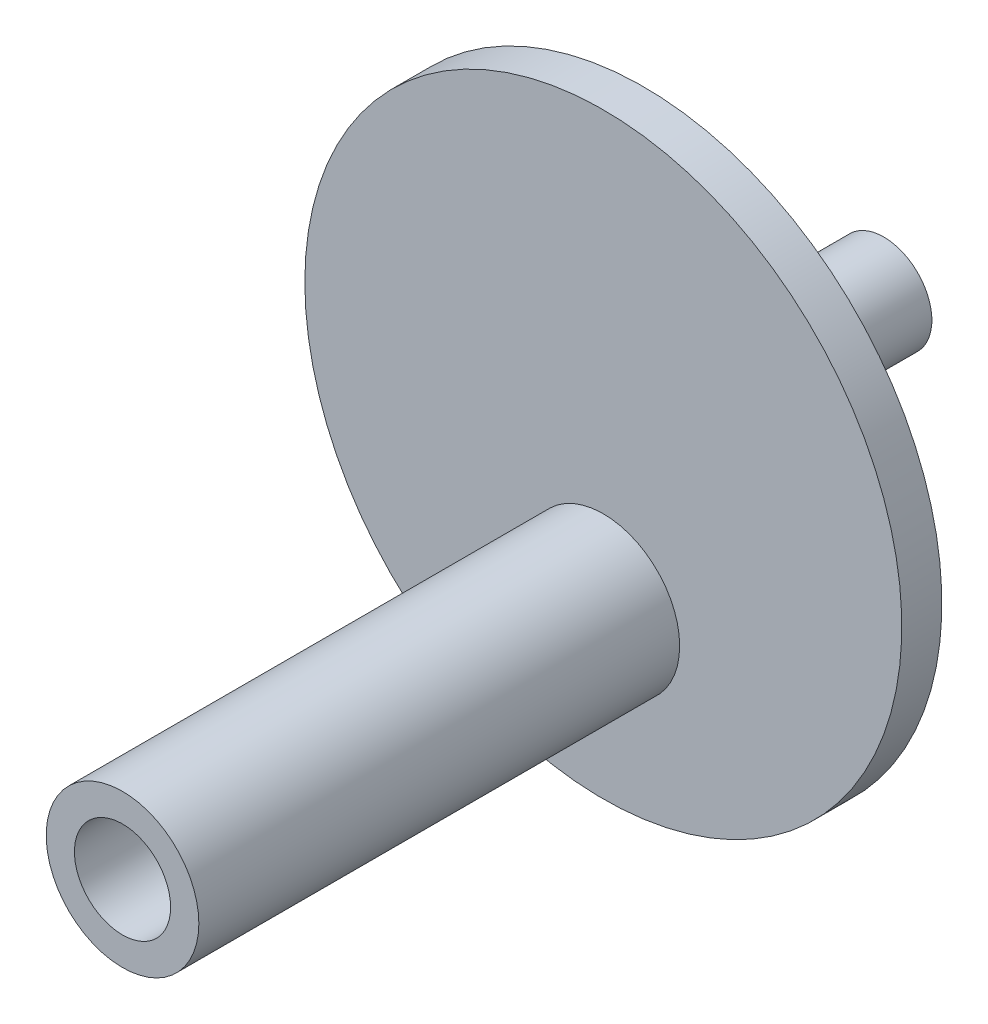
ISO-10303-21;
HEADER;
FILE_DESCRIPTION(('STEP AP214'),'2;1');
FILE_NAME('part.step','',(''),(''),'','','');
FILE_SCHEMA(('AUTOMOTIVE_DESIGN { 1 0 10303 214 1 1 1 1 }'));
ENDSEC;
DATA;
#1=APPLICATION_CONTEXT('core data for automotive mechanical design processes');
#2=APPLICATION_PROTOCOL_DEFINITION('international standard','automotive_design',2000,#1);
#3=PRODUCT_CONTEXT('',#1,'mechanical');
#4=PRODUCT('Part','Part','',(#3));
#5=PRODUCT_RELATED_PRODUCT_CATEGORY('part','',(#4));
#6=PRODUCT_DEFINITION_FORMATION('','',#4);
#7=PRODUCT_DEFINITION_CONTEXT('part definition',#1,'design');
#8=PRODUCT_DEFINITION('design','',#6,#7);
#9=PRODUCT_DEFINITION_SHAPE('','',#8);
#10=(LENGTH_UNIT() NAMED_UNIT(*) SI_UNIT(.MILLI.,.METRE.));
#11=(NAMED_UNIT(*) PLANE_ANGLE_UNIT() SI_UNIT($,.RADIAN.));
#12=(NAMED_UNIT(*) SI_UNIT($,.STERADIAN.) SOLID_ANGLE_UNIT());
#13=UNCERTAINTY_MEASURE_WITH_UNIT(LENGTH_MEASURE(1.E-05),#10,'distance_accuracy_value','');
#14=(GEOMETRIC_REPRESENTATION_CONTEXT(3) GLOBAL_UNCERTAINTY_ASSIGNED_CONTEXT((#13)) GLOBAL_UNIT_ASSIGNED_CONTEXT((#10,
#11,#12)) REPRESENTATION_CONTEXT('',''));
#15=CARTESIAN_POINT('',(0.,0.,0.));
#16=DIRECTION('',(0.,0.,1.));
#17=DIRECTION('',(1.,0.,0.));
#18=AXIS2_PLACEMENT_3D('',#15,#16,#17);
#19=CARTESIAN_POINT('',(0.,0.,-30.));
#20=DIRECTION('',(0.,0.,-1.));
#21=DIRECTION('',(-1.,0.,0.));
#22=AXIS2_PLACEMENT_3D('',#19,#20,#21);
#23=CYLINDRICAL_SURFACE('',#22,8.);
#24=CARTESIAN_POINT('',(0.,0.,0.));
#25=DIRECTION('',(0.,0.,-1.));
#26=DIRECTION('',(-1.,0.,0.));
#27=AXIS2_PLACEMENT_3D('',#24,#25,#26);
#28=CIRCLE('',#27,8.);
#29=CARTESIAN_POINT('',(-8.,0.,0.));
#30=VERTEX_POINT('',#29);
#31=EDGE_CURVE('E59',#30,#30,#28,.T.);
#32=ORIENTED_EDGE('',*,*,#31,.T.);
#33=EDGE_LOOP('',(#32));
#34=FACE_BOUND('',#33,.T.);
#35=CARTESIAN_POINT('',(0.,0.,-15.1));
#36=DIRECTION('',(0.,0.,-1.));
#37=DIRECTION('',(-1.,0.,0.));
#38=AXIS2_PLACEMENT_3D('',#35,#36,#37);
#39=CIRCLE('',#38,8.);
#40=CARTESIAN_POINT('',(-8.,0.,-15.1));
#41=VERTEX_POINT('',#40);
#42=EDGE_CURVE('E40',#41,#41,#39,.T.);
#43=ORIENTED_EDGE('',*,*,#42,.F.);
#44=EDGE_LOOP('',(#43));
#45=FACE_BOUND('',#44,.T.);
#46=ADVANCED_FACE('F34',(#34,#45),#23,.T.);
#47=CARTESIAN_POINT('',(0.,8.,-15.1));
#48=DIRECTION('',(0.,0.,-1.));
#49=DIRECTION('',(-1.,0.,0.));
#50=AXIS2_PLACEMENT_3D('',#47,#48,#49);
#51=PLANE('',#50);
#52=ORIENTED_EDGE('',*,*,#42,.T.);
#53=EDGE_LOOP('',(#52));
#54=FACE_BOUND('',#53,.T.);
#55=CARTESIAN_POINT('',(0.,0.,-15.1));
#56=DIRECTION('',(0.,0.,-1.));
#57=DIRECTION('',(-1.,0.,0.));
#58=AXIS2_PLACEMENT_3D('',#55,#56,#57);
#59=CIRCLE('',#58,6.);
#60=CARTESIAN_POINT('',(-6.,0.,-15.1));
#61=VERTEX_POINT('',#60);
#62=EDGE_CURVE('E44',#61,#61,#59,.T.);
#63=ORIENTED_EDGE('',*,*,#62,.F.);
#64=EDGE_LOOP('',(#63));
#65=FACE_BOUND('',#64,.T.);
#66=ADVANCED_FACE('F91',(#54,#65),#51,.T.);
#67=CARTESIAN_POINT('',(0.,0.,-30.));
#68=DIRECTION('',(0.,0.,-1.));
#69=DIRECTION('',(-1.,0.,0.));
#70=AXIS2_PLACEMENT_3D('',#67,#68,#69);
#71=CYLINDRICAL_SURFACE('',#70,6.);
#72=ORIENTED_EDGE('',*,*,#62,.T.);
#73=EDGE_LOOP('',(#72));
#74=FACE_BOUND('',#73,.T.);
#75=CARTESIAN_POINT('',(0.,0.,-30.));
#76=DIRECTION('',(0.,0.,-1.));
#77=DIRECTION('',(-1.,0.,0.));
#78=AXIS2_PLACEMENT_3D('',#75,#76,#77);
#79=CIRCLE('',#78,6.);
#80=CARTESIAN_POINT('',(-6.,0.,-30.));
#81=VERTEX_POINT('',#80);
#82=EDGE_CURVE('E48',#81,#81,#79,.T.);
#83=ORIENTED_EDGE('',*,*,#82,.F.);
#84=EDGE_LOOP('',(#83));
#85=FACE_BOUND('',#84,.T.);
#86=ADVANCED_FACE('F96',(#74,#85),#71,.T.);
#87=CARTESIAN_POINT('',(0.,6.,-30.));
#88=DIRECTION('',(0.,0.,-1.));
#89=DIRECTION('',(-1.,0.,0.));
#90=AXIS2_PLACEMENT_3D('',#87,#88,#89);
#91=PLANE('',#90);
#92=ORIENTED_EDGE('',*,*,#82,.T.);
#93=EDGE_LOOP('',(#92));
#94=FACE_BOUND('',#93,.T.);
#95=ADVANCED_FACE('F103',(#94),#91,.T.);
#96=CARTESIAN_POINT('',(0.,37.25,5.));
#97=DIRECTION('',(0.,0.,1.));
#98=DIRECTION('',(1.,0.,0.));
#99=AXIS2_PLACEMENT_3D('',#96,#97,#98);
#100=PLANE('',#99);
#101=CARTESIAN_POINT('',(0.,-15.9375,5.));
#102=DIRECTION('',(0.,0.,1.));
#103=DIRECTION('',(1.,0.,0.));
#104=AXIS2_PLACEMENT_3D('',#101,#102,#103);
#105=CIRCLE('',#104,9.525);
#106=CARTESIAN_POINT('',(9.525,-15.9375,5.));
#107=VERTEX_POINT('',#106);
#108=EDGE_CURVE('E63',#107,#107,#105,.T.);
#109=ORIENTED_EDGE('',*,*,#108,.F.);
#110=EDGE_LOOP('',(#109));
#111=FACE_BOUND('',#110,.T.);
#112=CARTESIAN_POINT('',(0.,0.,5.));
#113=DIRECTION('',(0.,0.,-1.));
#114=DIRECTION('',(-1.,0.,0.));
#115=AXIS2_PLACEMENT_3D('',#112,#113,#114);
#116=CIRCLE('',#115,37.25);
#117=CARTESIAN_POINT('',(-37.25,0.,5.));
#118=VERTEX_POINT('',#117);
#119=EDGE_CURVE('E53',#118,#118,#116,.T.);
#120=ORIENTED_EDGE('',*,*,#119,.F.);
#121=EDGE_LOOP('',(#120));
#122=FACE_BOUND('',#121,.T.);
#123=ADVANCED_FACE('F110',(#111,#122),#100,.T.);
#124=CARTESIAN_POINT('',(0.,0.,-30.));
#125=DIRECTION('',(0.,0.,-1.));
#126=DIRECTION('',(-1.,0.,0.));
#127=AXIS2_PLACEMENT_3D('',#124,#125,#126);
#128=CYLINDRICAL_SURFACE('',#127,37.25);
#129=ORIENTED_EDGE('',*,*,#119,.T.);
#130=EDGE_LOOP('',(#129));
#131=FACE_BOUND('',#130,.T.);
#132=CARTESIAN_POINT('',(0.,0.,0.));
#133=DIRECTION('',(0.,0.,-1.));
#134=DIRECTION('',(-1.,0.,0.));
#135=AXIS2_PLACEMENT_3D('',#132,#133,#134);
#136=CIRCLE('',#135,37.25);
#137=CARTESIAN_POINT('',(-37.25,0.,0.));
#138=VERTEX_POINT('',#137);
#139=EDGE_CURVE('E56',#138,#138,#136,.T.);
#140=ORIENTED_EDGE('',*,*,#139,.F.);
#141=EDGE_LOOP('',(#140));
#142=FACE_BOUND('',#141,.T.);
#143=ADVANCED_FACE('F86',(#131,#142),#128,.T.);
#144=CARTESIAN_POINT('',(0.,8.,0.));
#145=DIRECTION('',(0.,0.,-1.));
#146=DIRECTION('',(-1.,0.,0.));
#147=AXIS2_PLACEMENT_3D('',#144,#145,#146);
#148=PLANE('',#147);
#149=ORIENTED_EDGE('',*,*,#139,.T.);
#150=EDGE_LOOP('',(#149));
#151=FACE_BOUND('',#150,.T.);
#152=ORIENTED_EDGE('',*,*,#31,.F.);
#153=EDGE_LOOP('',(#152));
#154=FACE_BOUND('',#153,.T.);
#155=ADVANCED_FACE('F77',(#151,#154),#148,.T.);
#156=CARTESIAN_POINT('',(0.,-15.9375,65.));
#157=DIRECTION('',(0.,0.,1.));
#158=DIRECTION('',(1.,0.,0.));
#159=AXIS2_PLACEMENT_3D('',#156,#157,#158);
#160=PLANE('',#159);
#161=CARTESIAN_POINT('',(0.,-15.9375,65.));
#162=DIRECTION('',(0.,0.,1.));
#163=DIRECTION('',(1.,0.,0.));
#164=AXIS2_PLACEMENT_3D('',#161,#162,#163);
#165=CIRCLE('',#164,9.525);
#166=CARTESIAN_POINT('',(9.525,-15.9375,65.));
#167=VERTEX_POINT('',#166);
#168=EDGE_CURVE('E62',#167,#167,#165,.T.);
#169=ORIENTED_EDGE('',*,*,#168,.T.);
#170=EDGE_LOOP('',(#169));
#171=FACE_BOUND('',#170,.T.);
#172=CARTESIAN_POINT('',(0.,-15.9375,65.));
#173=DIRECTION('',(0.,0.,1.));
#174=DIRECTION('',(1.,0.,0.));
#175=AXIS2_PLACEMENT_3D('',#172,#173,#174);
#176=CIRCLE('',#175,6.);
#177=CARTESIAN_POINT('',(6.,-15.9375,65.));
#178=VERTEX_POINT('',#177);
#179=EDGE_CURVE('E66',#178,#178,#176,.T.);
#180=ORIENTED_EDGE('',*,*,#179,.F.);
#181=EDGE_LOOP('',(#180));
#182=FACE_BOUND('',#181,.T.);
#183=ADVANCED_FACE('F74',(#171,#182),#160,.T.);
#184=CARTESIAN_POINT('',(0.,-15.9375,65.));
#185=DIRECTION('',(0.,0.,-1.));
#186=DIRECTION('',(-1.,0.,0.));
#187=AXIS2_PLACEMENT_3D('',#184,#185,#186);
#188=CYLINDRICAL_SURFACE('',#187,9.525);
#189=ORIENTED_EDGE('',*,*,#168,.F.);
#190=EDGE_LOOP('',(#189));
#191=FACE_BOUND('',#190,.T.);
#192=ORIENTED_EDGE('',*,*,#108,.T.);
#193=EDGE_LOOP('',(#192));
#194=FACE_BOUND('',#193,.T.);
#195=ADVANCED_FACE('F76',(#191,#194),#188,.T.);
#196=CARTESIAN_POINT('',(0.,-15.9375,65.));
#197=DIRECTION('',(0.,0.,-1.));
#198=DIRECTION('',(-1.,0.,0.));
#199=AXIS2_PLACEMENT_3D('',#196,#197,#198);
#200=CYLINDRICAL_SURFACE('',#199,6.);
#201=ORIENTED_EDGE('',*,*,#179,.T.);
#202=EDGE_LOOP('',(#201));
#203=FACE_BOUND('',#202,.T.);
#204=CARTESIAN_POINT('',(0.,-15.9375,5.));
#205=DIRECTION('',(0.,0.,1.));
#206=DIRECTION('',(1.,0.,0.));
#207=AXIS2_PLACEMENT_3D('',#204,#205,#206);
#208=CIRCLE('',#207,6.);
#209=CARTESIAN_POINT('',(6.,-15.9375,5.));
#210=VERTEX_POINT('',#209);
#211=EDGE_CURVE('E10',#210,#210,#208,.F.);
#212=ORIENTED_EDGE('',*,*,#211,.T.);
#213=EDGE_LOOP('',(#212));
#214=FACE_BOUND('',#213,.T.);
#215=ADVANCED_FACE('F72',(#203,#214),#200,.F.);
#216=ORIENTED_EDGE('',*,*,#211,.F.);
#217=EDGE_LOOP('',(#216));
#218=FACE_BOUND('',#217,.T.);
#219=ADVANCED_FACE('F115',(#218),#100,.T.);
#220=CLOSED_SHELL('',(#46,#66,#86,#95,#123,#143,#155,#183,#195,#215,#219));
#221=MANIFOLD_SOLID_BREP('B2',#220);
#222=ADVANCED_BREP_SHAPE_REPRESENTATION('',(#18,#221),#14);
#223=SHAPE_DEFINITION_REPRESENTATION(#9,#222);
ENDSEC;
END-ISO-10303-21;
